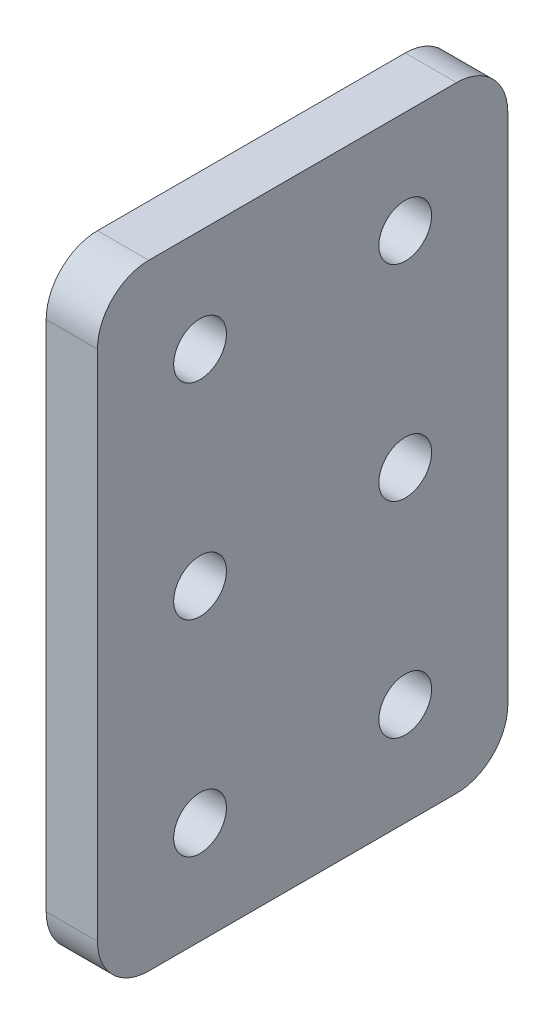
ISO-10303-21;
HEADER;
FILE_DESCRIPTION(('STEP AP214'),'2;1');
FILE_NAME('part.step','',(''),(''),'','','');
FILE_SCHEMA(('AUTOMOTIVE_DESIGN { 1 0 10303 214 1 1 1 1 }'));
ENDSEC;
DATA;
#1=APPLICATION_CONTEXT('core data for automotive mechanical design processes');
#2=APPLICATION_PROTOCOL_DEFINITION('international standard','automotive_design',2000,#1);
#3=PRODUCT_CONTEXT('',#1,'mechanical');
#4=PRODUCT('Part','Part','',(#3));
#5=PRODUCT_RELATED_PRODUCT_CATEGORY('part','',(#4));
#6=PRODUCT_DEFINITION_FORMATION('','',#4);
#7=PRODUCT_DEFINITION_CONTEXT('part definition',#1,'design');
#8=PRODUCT_DEFINITION('design','',#6,#7);
#9=PRODUCT_DEFINITION_SHAPE('','',#8);
#10=(LENGTH_UNIT() NAMED_UNIT(*) SI_UNIT(.MILLI.,.METRE.));
#11=(NAMED_UNIT(*) PLANE_ANGLE_UNIT() SI_UNIT($,.RADIAN.));
#12=(NAMED_UNIT(*) SI_UNIT($,.STERADIAN.) SOLID_ANGLE_UNIT());
#13=UNCERTAINTY_MEASURE_WITH_UNIT(LENGTH_MEASURE(1.E-05),#10,'distance_accuracy_value','');
#14=(GEOMETRIC_REPRESENTATION_CONTEXT(3) GLOBAL_UNCERTAINTY_ASSIGNED_CONTEXT((#13)) GLOBAL_UNIT_ASSIGNED_CONTEXT((#10,
#11,#12)) REPRESENTATION_CONTEXT('',''));
#15=CARTESIAN_POINT('',(0.,0.,0.));
#16=DIRECTION('',(0.,0.,1.));
#17=DIRECTION('',(1.,0.,0.));
#18=AXIS2_PLACEMENT_3D('',#15,#16,#17);
#19=CARTESIAN_POINT('',(6.35,76.2,0.));
#20=DIRECTION('',(-1.,0.,0.));
#21=DIRECTION('',(0.,0.,1.));
#22=AXIS2_PLACEMENT_3D('',#19,#20,#21);
#23=PLANE('',#22);
#24=CARTESIAN_POINT('',(6.35,12.7,-12.7000000000005));
#25=DIRECTION('',(1.,0.,0.));
#26=DIRECTION('',(0.,0.,-1.));
#27=AXIS2_PLACEMENT_3D('',#24,#25,#26);
#28=CIRCLE('',#27,3.2639);
#29=CARTESIAN_POINT('',(6.35,12.7,-15.9639000000005));
#30=VERTEX_POINT('',#29);
#31=EDGE_CURVE('E199',#30,#30,#28,.T.);
#32=ORIENTED_EDGE('',*,*,#31,.F.);
#33=EDGE_LOOP('',(#32));
#34=FACE_BOUND('',#33,.T.);
#35=CARTESIAN_POINT('',(6.35,38.1,-12.7000000000003));
#36=DIRECTION('',(1.,0.,0.));
#37=DIRECTION('',(0.,0.,-1.));
#38=AXIS2_PLACEMENT_3D('',#35,#36,#37);
#39=CIRCLE('',#38,3.2639);
#40=CARTESIAN_POINT('',(6.35,38.1,-15.9639000000003));
#41=VERTEX_POINT('',#40);
#42=EDGE_CURVE('E187',#41,#41,#39,.T.);
#43=ORIENTED_EDGE('',*,*,#42,.F.);
#44=EDGE_LOOP('',(#43));
#45=FACE_BOUND('',#44,.T.);
#46=CARTESIAN_POINT('',(6.35,63.5,-12.7));
#47=DIRECTION('',(1.,0.,0.));
#48=DIRECTION('',(0.,0.,-1.));
#49=AXIS2_PLACEMENT_3D('',#46,#47,#48);
#50=CIRCLE('',#49,3.2639);
#51=CARTESIAN_POINT('',(6.35,63.5,-15.9639));
#52=VERTEX_POINT('',#51);
#53=EDGE_CURVE('E174',#52,#52,#50,.T.);
#54=ORIENTED_EDGE('',*,*,#53,.F.);
#55=EDGE_LOOP('',(#54));
#56=FACE_BOUND('',#55,.T.);
#57=DIRECTION('',(0.,0.,-1.));
#58=VECTOR('',#57,1.);
#59=CARTESIAN_POINT('',(6.35,0.,0.));
#60=LINE('',#59,#58);
#61=CARTESIAN_POINT('',(6.35,0.,-6.35));
#62=VERTEX_POINT('',#61);
#63=CARTESIAN_POINT('',(6.35,0.,-44.45));
#64=VERTEX_POINT('',#63);
#65=EDGE_CURVE('E135',#62,#64,#60,.T.);
#66=ORIENTED_EDGE('',*,*,#65,.T.);
#67=CARTESIAN_POINT('',(6.35,6.35,-44.45));
#68=DIRECTION('',(-1.,0.,0.));
#69=DIRECTION('',(0.,0.,1.));
#70=AXIS2_PLACEMENT_3D('',#67,#68,#69);
#71=CIRCLE('',#70,6.35);
#72=CARTESIAN_POINT('',(6.35,6.35,-50.8));
#73=VERTEX_POINT('',#72);
#74=EDGE_CURVE('E153',#64,#73,#71,.F.);
#75=ORIENTED_EDGE('',*,*,#74,.T.);
#76=DIRECTION('',(0.,1.,0.));
#77=VECTOR('',#76,1.);
#78=CARTESIAN_POINT('',(6.35,0.,-50.8));
#79=LINE('',#78,#77);
#80=CARTESIAN_POINT('',(6.35,69.85,-50.8));
#81=VERTEX_POINT('',#80);
#82=EDGE_CURVE('E116',#73,#81,#79,.T.);
#83=ORIENTED_EDGE('',*,*,#82,.T.);
#84=CARTESIAN_POINT('',(6.35,69.85,-44.45));
#85=DIRECTION('',(-1.,0.,0.));
#86=DIRECTION('',(0.,0.,1.));
#87=AXIS2_PLACEMENT_3D('',#84,#85,#86);
#88=CIRCLE('',#87,6.35);
#89=CARTESIAN_POINT('',(6.35,76.2,-44.45));
#90=VERTEX_POINT('',#89);
#91=EDGE_CURVE('E52',#81,#90,#88,.F.);
#92=ORIENTED_EDGE('',*,*,#91,.T.);
#93=DIRECTION('',(0.,0.,1.));
#94=VECTOR('',#93,1.);
#95=CARTESIAN_POINT('',(6.35,76.2,0.));
#96=LINE('',#95,#94);
#97=CARTESIAN_POINT('',(6.35,76.2,-6.35));
#98=VERTEX_POINT('',#97);
#99=EDGE_CURVE('E139',#90,#98,#96,.T.);
#100=ORIENTED_EDGE('',*,*,#99,.T.);
#101=CARTESIAN_POINT('',(6.35,69.85,-6.35));
#102=DIRECTION('',(-1.,0.,0.));
#103=DIRECTION('',(0.,0.,1.));
#104=AXIS2_PLACEMENT_3D('',#101,#102,#103);
#105=CIRCLE('',#104,6.35);
#106=CARTESIAN_POINT('',(6.35,69.85,0.));
#107=VERTEX_POINT('',#106);
#108=EDGE_CURVE('E148',#98,#107,#105,.F.);
#109=ORIENTED_EDGE('',*,*,#108,.T.);
#110=DIRECTION('',(0.,-1.,0.));
#111=VECTOR('',#110,1.);
#112=CARTESIAN_POINT('',(6.35,0.,0.));
#113=LINE('',#112,#111);
#114=CARTESIAN_POINT('',(6.35,6.35,0.));
#115=VERTEX_POINT('',#114);
#116=EDGE_CURVE('E127',#107,#115,#113,.T.);
#117=ORIENTED_EDGE('',*,*,#116,.T.);
#118=CARTESIAN_POINT('',(6.35,6.35,-6.35));
#119=DIRECTION('',(-1.,0.,0.));
#120=DIRECTION('',(0.,0.,1.));
#121=AXIS2_PLACEMENT_3D('',#118,#119,#120);
#122=CIRCLE('',#121,6.35);
#123=EDGE_CURVE('E151',#115,#62,#122,.F.);
#124=ORIENTED_EDGE('',*,*,#123,.T.);
#125=EDGE_LOOP('',(#66,#75,#83,#92,#100,#109,#117,#124));
#126=FACE_BOUND('',#125,.T.);
#127=CARTESIAN_POINT('',(6.35,63.5,-38.1));
#128=DIRECTION('',(1.,0.,0.));
#129=DIRECTION('',(0.,0.,-1.));
#130=AXIS2_PLACEMENT_3D('',#127,#128,#129);
#131=CIRCLE('',#130,3.26390000000001);
#132=CARTESIAN_POINT('',(6.35,63.5,-41.3639));
#133=VERTEX_POINT('',#132);
#134=EDGE_CURVE('E181',#133,#133,#131,.T.);
#135=ORIENTED_EDGE('',*,*,#134,.F.);
#136=EDGE_LOOP('',(#135));
#137=FACE_BOUND('',#136,.T.);
#138=CARTESIAN_POINT('',(6.35,38.1,-38.1000000000003));
#139=DIRECTION('',(1.,0.,0.));
#140=DIRECTION('',(0.,0.,-1.));
#141=AXIS2_PLACEMENT_3D('',#138,#139,#140);
#142=CIRCLE('',#141,3.2639);
#143=CARTESIAN_POINT('',(6.35,38.1,-41.3639000000003));
#144=VERTEX_POINT('',#143);
#145=EDGE_CURVE('E193',#144,#144,#142,.T.);
#146=ORIENTED_EDGE('',*,*,#145,.F.);
#147=EDGE_LOOP('',(#146));
#148=FACE_BOUND('',#147,.T.);
#149=CARTESIAN_POINT('',(6.35,12.7,-38.1000000000005));
#150=DIRECTION('',(1.,0.,0.));
#151=DIRECTION('',(0.,0.,-1.));
#152=AXIS2_PLACEMENT_3D('',#149,#150,#151);
#153=CIRCLE('',#152,3.2639);
#154=CARTESIAN_POINT('',(6.35,12.7,-41.3639000000005));
#155=VERTEX_POINT('',#154);
#156=EDGE_CURVE('E205',#155,#155,#153,.T.);
#157=ORIENTED_EDGE('',*,*,#156,.F.);
#158=EDGE_LOOP('',(#157));
#159=FACE_BOUND('',#158,.T.);
#160=ADVANCED_FACE('F31',(#34,#45,#56,#126,#137,#148,#159),#23,.F.);
#161=CARTESIAN_POINT('',(0.,76.2,0.));
#162=DIRECTION('',(-1.,0.,0.));
#163=DIRECTION('',(0.,0.,1.));
#164=AXIS2_PLACEMENT_3D('',#161,#162,#163);
#165=PLANE('',#164);
#166=CARTESIAN_POINT('',(0.,12.7,-12.7000000000005));
#167=DIRECTION('',(1.,0.,0.));
#168=DIRECTION('',(0.,0.,-1.));
#169=AXIS2_PLACEMENT_3D('',#166,#167,#168);
#170=CIRCLE('',#169,3.2639);
#171=CARTESIAN_POINT('',(0.,12.7,-15.9639000000005));
#172=VERTEX_POINT('',#171);
#173=EDGE_CURVE('E202',#172,#172,#170,.T.);
#174=ORIENTED_EDGE('',*,*,#173,.T.);
#175=EDGE_LOOP('',(#174));
#176=FACE_BOUND('',#175,.T.);
#177=CARTESIAN_POINT('',(0.,38.1,-12.7000000000003));
#178=DIRECTION('',(1.,0.,0.));
#179=DIRECTION('',(0.,0.,-1.));
#180=AXIS2_PLACEMENT_3D('',#177,#178,#179);
#181=CIRCLE('',#180,3.2639);
#182=CARTESIAN_POINT('',(0.,38.1,-15.9639000000003));
#183=VERTEX_POINT('',#182);
#184=EDGE_CURVE('E190',#183,#183,#181,.T.);
#185=ORIENTED_EDGE('',*,*,#184,.T.);
#186=EDGE_LOOP('',(#185));
#187=FACE_BOUND('',#186,.T.);
#188=CARTESIAN_POINT('',(0.,63.5,-12.7));
#189=DIRECTION('',(1.,0.,0.));
#190=DIRECTION('',(0.,0.,-1.));
#191=AXIS2_PLACEMENT_3D('',#188,#189,#190);
#192=CIRCLE('',#191,3.2639);
#193=CARTESIAN_POINT('',(0.,63.5,-15.9639));
#194=VERTEX_POINT('',#193);
#195=EDGE_CURVE('E176',#194,#194,#192,.T.);
#196=ORIENTED_EDGE('',*,*,#195,.T.);
#197=EDGE_LOOP('',(#196));
#198=FACE_BOUND('',#197,.T.);
#199=DIRECTION('',(0.,1.,0.));
#200=VECTOR('',#199,1.);
#201=CARTESIAN_POINT('',(0.,0.,-50.8));
#202=LINE('',#201,#200);
#203=CARTESIAN_POINT('',(0.,6.35,-50.8));
#204=VERTEX_POINT('',#203);
#205=CARTESIAN_POINT('',(0.,69.85,-50.8));
#206=VERTEX_POINT('',#205);
#207=EDGE_CURVE('E114',#204,#206,#202,.T.);
#208=ORIENTED_EDGE('',*,*,#207,.F.);
#209=CARTESIAN_POINT('',(0.,6.35,-44.45));
#210=DIRECTION('',(-1.,0.,0.));
#211=DIRECTION('',(0.,0.,1.));
#212=AXIS2_PLACEMENT_3D('',#209,#210,#211);
#213=CIRCLE('',#212,6.35);
#214=CARTESIAN_POINT('',(0.,0.,-44.45));
#215=VERTEX_POINT('',#214);
#216=EDGE_CURVE('E97',#204,#215,#213,.T.);
#217=ORIENTED_EDGE('',*,*,#216,.T.);
#218=DIRECTION('',(0.,0.,-1.));
#219=VECTOR('',#218,1.);
#220=CARTESIAN_POINT('',(0.,0.,0.));
#221=LINE('',#220,#219);
#222=CARTESIAN_POINT('',(0.,0.,-6.35));
#223=VERTEX_POINT('',#222);
#224=EDGE_CURVE('E125',#223,#215,#221,.T.);
#225=ORIENTED_EDGE('',*,*,#224,.F.);
#226=CARTESIAN_POINT('',(0.,6.35,-6.35));
#227=DIRECTION('',(-1.,0.,0.));
#228=DIRECTION('',(0.,0.,1.));
#229=AXIS2_PLACEMENT_3D('',#226,#227,#228);
#230=CIRCLE('',#229,6.35);
#231=CARTESIAN_POINT('',(0.,6.35,0.));
#232=VERTEX_POINT('',#231);
#233=EDGE_CURVE('E108',#223,#232,#230,.T.);
#234=ORIENTED_EDGE('',*,*,#233,.T.);
#235=DIRECTION('',(0.,-1.,0.));
#236=VECTOR('',#235,1.);
#237=CARTESIAN_POINT('',(0.,0.,0.));
#238=LINE('',#237,#236);
#239=CARTESIAN_POINT('',(0.,69.85,0.));
#240=VERTEX_POINT('',#239);
#241=EDGE_CURVE('E129',#240,#232,#238,.T.);
#242=ORIENTED_EDGE('',*,*,#241,.F.);
#243=CARTESIAN_POINT('',(0.,69.85,-6.35));
#244=DIRECTION('',(-1.,0.,0.));
#245=DIRECTION('',(0.,0.,1.));
#246=AXIS2_PLACEMENT_3D('',#243,#244,#245);
#247=CIRCLE('',#246,6.35);
#248=CARTESIAN_POINT('',(0.,76.2,-6.35));
#249=VERTEX_POINT('',#248);
#250=EDGE_CURVE('E117',#240,#249,#247,.T.);
#251=ORIENTED_EDGE('',*,*,#250,.T.);
#252=DIRECTION('',(0.,0.,1.));
#253=VECTOR('',#252,1.);
#254=CARTESIAN_POINT('',(0.,76.2,0.));
#255=LINE('',#254,#253);
#256=CARTESIAN_POINT('',(0.,76.2,-44.45));
#257=VERTEX_POINT('',#256);
#258=EDGE_CURVE('E124',#257,#249,#255,.T.);
#259=ORIENTED_EDGE('',*,*,#258,.F.);
#260=CARTESIAN_POINT('',(0.,69.85,-44.45));
#261=DIRECTION('',(-1.,0.,0.));
#262=DIRECTION('',(0.,0.,1.));
#263=AXIS2_PLACEMENT_3D('',#260,#261,#262);
#264=CIRCLE('',#263,6.35);
#265=EDGE_CURVE('E123',#257,#206,#264,.T.);
#266=ORIENTED_EDGE('',*,*,#265,.T.);
#267=EDGE_LOOP('',(#208,#217,#225,#234,#242,#251,#259,#266));
#268=FACE_BOUND('',#267,.T.);
#269=CARTESIAN_POINT('',(0.,63.5,-38.1));
#270=DIRECTION('',(1.,0.,0.));
#271=DIRECTION('',(0.,0.,-1.));
#272=AXIS2_PLACEMENT_3D('',#269,#270,#271);
#273=CIRCLE('',#272,3.26390000000001);
#274=CARTESIAN_POINT('',(0.,63.5,-41.3639));
#275=VERTEX_POINT('',#274);
#276=EDGE_CURVE('E184',#275,#275,#273,.T.);
#277=ORIENTED_EDGE('',*,*,#276,.T.);
#278=EDGE_LOOP('',(#277));
#279=FACE_BOUND('',#278,.T.);
#280=CARTESIAN_POINT('',(0.,38.1,-38.1000000000003));
#281=DIRECTION('',(1.,0.,0.));
#282=DIRECTION('',(0.,0.,-1.));
#283=AXIS2_PLACEMENT_3D('',#280,#281,#282);
#284=CIRCLE('',#283,3.2639);
#285=CARTESIAN_POINT('',(0.,38.1,-41.3639000000003));
#286=VERTEX_POINT('',#285);
#287=EDGE_CURVE('E196',#286,#286,#284,.T.);
#288=ORIENTED_EDGE('',*,*,#287,.T.);
#289=EDGE_LOOP('',(#288));
#290=FACE_BOUND('',#289,.T.);
#291=CARTESIAN_POINT('',(0.,12.7,-38.1000000000005));
#292=DIRECTION('',(1.,0.,0.));
#293=DIRECTION('',(0.,0.,-1.));
#294=AXIS2_PLACEMENT_3D('',#291,#292,#293);
#295=CIRCLE('',#294,3.2639);
#296=CARTESIAN_POINT('',(0.,12.7,-41.3639000000005));
#297=VERTEX_POINT('',#296);
#298=EDGE_CURVE('E208',#297,#297,#295,.T.);
#299=ORIENTED_EDGE('',*,*,#298,.T.);
#300=EDGE_LOOP('',(#299));
#301=FACE_BOUND('',#300,.T.);
#302=ADVANCED_FACE('F120',(#176,#187,#198,#268,#279,#290,#301),#165,.T.);
#303=CARTESIAN_POINT('',(6.35,0.,0.));
#304=DIRECTION('',(0.,0.,-1.));
#305=DIRECTION('',(-1.,0.,0.));
#306=AXIS2_PLACEMENT_3D('',#303,#304,#305);
#307=PLANE('',#306);
#308=ORIENTED_EDGE('',*,*,#241,.T.);
#309=DIRECTION('',(-1.,0.,0.));
#310=VECTOR('',#309,1.);
#311=CARTESIAN_POINT('',(6.35,6.35,0.));
#312=LINE('',#311,#310);
#313=EDGE_CURVE('E158',#232,#115,#312,.F.);
#314=ORIENTED_EDGE('',*,*,#313,.T.);
#315=ORIENTED_EDGE('',*,*,#116,.F.);
#316=DIRECTION('',(-1.,0.,0.));
#317=VECTOR('',#316,1.);
#318=CARTESIAN_POINT('',(6.35,69.85,0.));
#319=LINE('',#318,#317);
#320=EDGE_CURVE('E155',#107,#240,#319,.T.);
#321=ORIENTED_EDGE('',*,*,#320,.T.);
#322=EDGE_LOOP('',(#308,#314,#315,#321));
#323=FACE_BOUND('',#322,.T.);
#324=ADVANCED_FACE('F33',(#323),#307,.F.);
#325=CARTESIAN_POINT('',(6.35,0.,0.));
#326=DIRECTION('',(0.,1.,0.));
#327=DIRECTION('',(0.,0.,1.));
#328=AXIS2_PLACEMENT_3D('',#325,#326,#327);
#329=PLANE('',#328);
#330=ORIENTED_EDGE('',*,*,#224,.T.);
#331=DIRECTION('',(-1.,0.,0.));
#332=VECTOR('',#331,1.);
#333=CARTESIAN_POINT('',(6.35,0.,-44.45));
#334=LINE('',#333,#332);
#335=EDGE_CURVE('E102',#215,#64,#334,.F.);
#336=ORIENTED_EDGE('',*,*,#335,.T.);
#337=ORIENTED_EDGE('',*,*,#65,.F.);
#338=DIRECTION('',(-1.,0.,0.));
#339=VECTOR('',#338,1.);
#340=CARTESIAN_POINT('',(6.35,0.,-6.35));
#341=LINE('',#340,#339);
#342=EDGE_CURVE('E107',#62,#223,#341,.T.);
#343=ORIENTED_EDGE('',*,*,#342,.T.);
#344=EDGE_LOOP('',(#330,#336,#337,#343));
#345=FACE_BOUND('',#344,.T.);
#346=ADVANCED_FACE('F173',(#345),#329,.F.);
#347=CARTESIAN_POINT('',(6.35,0.,-50.8));
#348=DIRECTION('',(0.,0.,1.));
#349=DIRECTION('',(1.,0.,0.));
#350=AXIS2_PLACEMENT_3D('',#347,#348,#349);
#351=PLANE('',#350);
#352=ORIENTED_EDGE('',*,*,#82,.F.);
#353=DIRECTION('',(-1.,0.,0.));
#354=VECTOR('',#353,1.);
#355=CARTESIAN_POINT('',(6.35,6.35,-50.8));
#356=LINE('',#355,#354);
#357=EDGE_CURVE('E101',#73,#204,#356,.T.);
#358=ORIENTED_EDGE('',*,*,#357,.T.);
#359=ORIENTED_EDGE('',*,*,#207,.T.);
#360=DIRECTION('',(-1.,0.,0.));
#361=VECTOR('',#360,1.);
#362=CARTESIAN_POINT('',(6.35,69.85,-50.8));
#363=LINE('',#362,#361);
#364=EDGE_CURVE('E118',#206,#81,#363,.F.);
#365=ORIENTED_EDGE('',*,*,#364,.T.);
#366=EDGE_LOOP('',(#352,#358,#359,#365));
#367=FACE_BOUND('',#366,.T.);
#368=ADVANCED_FACE('F113',(#367),#351,.F.);
#369=CARTESIAN_POINT('',(6.35,76.2,0.));
#370=DIRECTION('',(0.,-1.,0.));
#371=DIRECTION('',(0.,0.,-1.));
#372=AXIS2_PLACEMENT_3D('',#369,#370,#371);
#373=PLANE('',#372);
#374=ORIENTED_EDGE('',*,*,#99,.F.);
#375=DIRECTION('',(-1.,0.,0.));
#376=VECTOR('',#375,1.);
#377=CARTESIAN_POINT('',(6.35,76.2,-44.45));
#378=LINE('',#377,#376);
#379=EDGE_CURVE('E11',#90,#257,#378,.T.);
#380=ORIENTED_EDGE('',*,*,#379,.T.);
#381=ORIENTED_EDGE('',*,*,#258,.T.);
#382=DIRECTION('',(-1.,0.,0.));
#383=VECTOR('',#382,1.);
#384=CARTESIAN_POINT('',(6.35,76.2,-6.35));
#385=LINE('',#384,#383);
#386=EDGE_CURVE('E39',#249,#98,#385,.F.);
#387=ORIENTED_EDGE('',*,*,#386,.T.);
#388=EDGE_LOOP('',(#374,#380,#381,#387));
#389=FACE_BOUND('',#388,.T.);
#390=ADVANCED_FACE('F238',(#389),#373,.F.);
#391=CARTESIAN_POINT('',(6.35,63.5,-12.7));
#392=DIRECTION('',(-1.,0.,0.));
#393=DIRECTION('',(0.,0.,1.));
#394=AXIS2_PLACEMENT_3D('',#391,#392,#393);
#395=CYLINDRICAL_SURFACE('',#394,3.2639);
#396=ORIENTED_EDGE('',*,*,#53,.T.);
#397=EDGE_LOOP('',(#396));
#398=FACE_BOUND('',#397,.T.);
#399=ORIENTED_EDGE('',*,*,#195,.F.);
#400=EDGE_LOOP('',(#399));
#401=FACE_BOUND('',#400,.T.);
#402=ADVANCED_FACE('F241',(#398,#401),#395,.F.);
#403=CARTESIAN_POINT('',(6.35,63.5,-38.1));
#404=DIRECTION('',(-1.,0.,0.));
#405=DIRECTION('',(0.,0.,1.));
#406=AXIS2_PLACEMENT_3D('',#403,#404,#405);
#407=CYLINDRICAL_SURFACE('',#406,3.26390000000001);
#408=ORIENTED_EDGE('',*,*,#134,.T.);
#409=EDGE_LOOP('',(#408));
#410=FACE_BOUND('',#409,.T.);
#411=ORIENTED_EDGE('',*,*,#276,.F.);
#412=EDGE_LOOP('',(#411));
#413=FACE_BOUND('',#412,.T.);
#414=ADVANCED_FACE('F287',(#410,#413),#407,.F.);
#415=CARTESIAN_POINT('',(6.35,38.1,-12.7000000000003));
#416=DIRECTION('',(-1.,0.,0.));
#417=DIRECTION('',(0.,0.,1.));
#418=AXIS2_PLACEMENT_3D('',#415,#416,#417);
#419=CYLINDRICAL_SURFACE('',#418,3.2639);
#420=ORIENTED_EDGE('',*,*,#42,.T.);
#421=EDGE_LOOP('',(#420));
#422=FACE_BOUND('',#421,.T.);
#423=ORIENTED_EDGE('',*,*,#184,.F.);
#424=EDGE_LOOP('',(#423));
#425=FACE_BOUND('',#424,.T.);
#426=ADVANCED_FACE('F277',(#422,#425),#419,.F.);
#427=CARTESIAN_POINT('',(6.35,38.1,-38.1000000000003));
#428=DIRECTION('',(-1.,0.,0.));
#429=DIRECTION('',(0.,0.,1.));
#430=AXIS2_PLACEMENT_3D('',#427,#428,#429);
#431=CYLINDRICAL_SURFACE('',#430,3.2639);
#432=ORIENTED_EDGE('',*,*,#145,.T.);
#433=EDGE_LOOP('',(#432));
#434=FACE_BOUND('',#433,.T.);
#435=ORIENTED_EDGE('',*,*,#287,.F.);
#436=EDGE_LOOP('',(#435));
#437=FACE_BOUND('',#436,.T.);
#438=ADVANCED_FACE('F223',(#434,#437),#431,.F.);
#439=CARTESIAN_POINT('',(6.35,12.7,-12.7000000000005));
#440=DIRECTION('',(-1.,0.,0.));
#441=DIRECTION('',(0.,0.,1.));
#442=AXIS2_PLACEMENT_3D('',#439,#440,#441);
#443=CYLINDRICAL_SURFACE('',#442,3.2639);
#444=ORIENTED_EDGE('',*,*,#31,.T.);
#445=EDGE_LOOP('',(#444));
#446=FACE_BOUND('',#445,.T.);
#447=ORIENTED_EDGE('',*,*,#173,.F.);
#448=EDGE_LOOP('',(#447));
#449=FACE_BOUND('',#448,.T.);
#450=ADVANCED_FACE('F215',(#446,#449),#443,.F.);
#451=CARTESIAN_POINT('',(6.35,12.7,-38.1000000000005));
#452=DIRECTION('',(-1.,0.,0.));
#453=DIRECTION('',(0.,0.,1.));
#454=AXIS2_PLACEMENT_3D('',#451,#452,#453);
#455=CYLINDRICAL_SURFACE('',#454,3.2639);
#456=ORIENTED_EDGE('',*,*,#156,.T.);
#457=EDGE_LOOP('',(#456));
#458=FACE_BOUND('',#457,.T.);
#459=ORIENTED_EDGE('',*,*,#298,.F.);
#460=EDGE_LOOP('',(#459));
#461=FACE_BOUND('',#460,.T.);
#462=ADVANCED_FACE('F213',(#458,#461),#455,.F.);
#463=CARTESIAN_POINT('',(6.35,6.35,-44.45));
#464=DIRECTION('',(-1.,0.,0.));
#465=DIRECTION('',(0.,0.,1.));
#466=AXIS2_PLACEMENT_3D('',#463,#464,#465);
#467=CYLINDRICAL_SURFACE('',#466,6.35);
#468=ORIENTED_EDGE('',*,*,#74,.F.);
#469=ORIENTED_EDGE('',*,*,#335,.F.);
#470=ORIENTED_EDGE('',*,*,#216,.F.);
#471=ORIENTED_EDGE('',*,*,#357,.F.);
#472=EDGE_LOOP('',(#468,#469,#470,#471));
#473=FACE_BOUND('',#472,.T.);
#474=ADVANCED_FACE('F100',(#473),#467,.T.);
#475=CARTESIAN_POINT('',(6.35,6.35,-6.35));
#476=DIRECTION('',(-1.,0.,0.));
#477=DIRECTION('',(0.,0.,1.));
#478=AXIS2_PLACEMENT_3D('',#475,#476,#477);
#479=CYLINDRICAL_SURFACE('',#478,6.35);
#480=ORIENTED_EDGE('',*,*,#123,.F.);
#481=ORIENTED_EDGE('',*,*,#313,.F.);
#482=ORIENTED_EDGE('',*,*,#233,.F.);
#483=ORIENTED_EDGE('',*,*,#342,.F.);
#484=EDGE_LOOP('',(#480,#481,#482,#483));
#485=FACE_BOUND('',#484,.T.);
#486=ADVANCED_FACE('F171',(#485),#479,.T.);
#487=CARTESIAN_POINT('',(6.35,69.85,-44.45));
#488=DIRECTION('',(-1.,0.,0.));
#489=DIRECTION('',(0.,0.,1.));
#490=AXIS2_PLACEMENT_3D('',#487,#488,#489);
#491=CYLINDRICAL_SURFACE('',#490,6.35);
#492=ORIENTED_EDGE('',*,*,#91,.F.);
#493=ORIENTED_EDGE('',*,*,#364,.F.);
#494=ORIENTED_EDGE('',*,*,#265,.F.);
#495=ORIENTED_EDGE('',*,*,#379,.F.);
#496=EDGE_LOOP('',(#492,#493,#494,#495));
#497=FACE_BOUND('',#496,.T.);
#498=ADVANCED_FACE('F337',(#497),#491,.T.);
#499=CARTESIAN_POINT('',(6.35,69.85,-6.35));
#500=DIRECTION('',(-1.,0.,0.));
#501=DIRECTION('',(0.,0.,1.));
#502=AXIS2_PLACEMENT_3D('',#499,#500,#501);
#503=CYLINDRICAL_SURFACE('',#502,6.35);
#504=ORIENTED_EDGE('',*,*,#108,.F.);
#505=ORIENTED_EDGE('',*,*,#386,.F.);
#506=ORIENTED_EDGE('',*,*,#250,.F.);
#507=ORIENTED_EDGE('',*,*,#320,.F.);
#508=EDGE_LOOP('',(#504,#505,#506,#507));
#509=FACE_BOUND('',#508,.T.);
#510=ADVANCED_FACE('F346',(#509),#503,.T.);
#511=CLOSED_SHELL('',(#160,#302,#324,#346,#368,#390,#402,#414,#426,#438,#450,#462,#474,#486,
#498,#510));
#512=MANIFOLD_SOLID_BREP('B2',#511);
#513=ADVANCED_BREP_SHAPE_REPRESENTATION('',(#18,#512),#14);
#514=SHAPE_DEFINITION_REPRESENTATION(#9,#513);
ENDSEC;
END-ISO-10303-21;
